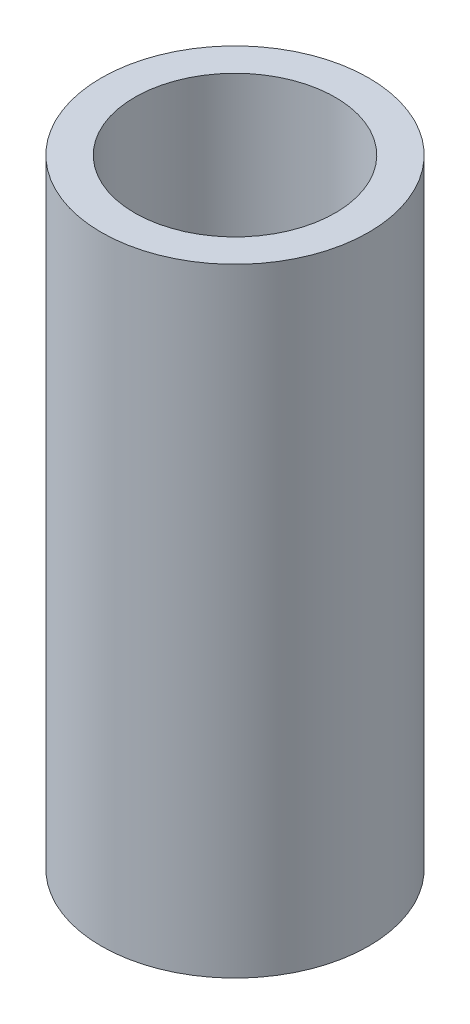
ISO-10303-21;
HEADER;
FILE_DESCRIPTION(('STEP AP214'),'2;1');
FILE_NAME('part.step','',(''),(''),'','','');
FILE_SCHEMA(('AUTOMOTIVE_DESIGN { 1 0 10303 214 1 1 1 1 }'));
ENDSEC;
DATA;
#1=APPLICATION_CONTEXT('core data for automotive mechanical design processes');
#2=APPLICATION_PROTOCOL_DEFINITION('international standard','automotive_design',2000,#1);
#3=PRODUCT_CONTEXT('',#1,'mechanical');
#4=PRODUCT('Part','Part','',(#3));
#5=PRODUCT_RELATED_PRODUCT_CATEGORY('part','',(#4));
#6=PRODUCT_DEFINITION_FORMATION('','',#4);
#7=PRODUCT_DEFINITION_CONTEXT('part definition',#1,'design');
#8=PRODUCT_DEFINITION('design','',#6,#7);
#9=PRODUCT_DEFINITION_SHAPE('','',#8);
#10=(LENGTH_UNIT() NAMED_UNIT(*) SI_UNIT(.MILLI.,.METRE.));
#11=(NAMED_UNIT(*) PLANE_ANGLE_UNIT() SI_UNIT($,.RADIAN.));
#12=(NAMED_UNIT(*) SI_UNIT($,.STERADIAN.) SOLID_ANGLE_UNIT());
#13=UNCERTAINTY_MEASURE_WITH_UNIT(LENGTH_MEASURE(1.E-05),#10,'distance_accuracy_value','');
#14=(GEOMETRIC_REPRESENTATION_CONTEXT(3) GLOBAL_UNCERTAINTY_ASSIGNED_CONTEXT((#13)) GLOBAL_UNIT_ASSIGNED_CONTEXT((#10,
#11,#12)) REPRESENTATION_CONTEXT('',''));
#15=CARTESIAN_POINT('',(0.,0.,0.));
#16=DIRECTION('',(0.,0.,1.));
#17=DIRECTION('',(1.,0.,0.));
#18=AXIS2_PLACEMENT_3D('',#15,#16,#17);
#19=CARTESIAN_POINT('',(0.,46.2111680227858,0.));
#20=DIRECTION('',(0.,-1.,0.));
#21=DIRECTION('',(0.,0.,-1.));
#22=AXIS2_PLACEMENT_3D('',#19,#20,#21);
#23=CYLINDRICAL_SURFACE('',#22,10.);
#24=CARTESIAN_POINT('',(0.,46.2111680227858,0.));
#25=DIRECTION('',(0.,1.,0.));
#26=DIRECTION('',(0.,0.,1.));
#27=AXIS2_PLACEMENT_3D('',#24,#25,#26);
#28=CIRCLE('',#27,10.);
#29=CARTESIAN_POINT('',(0.,46.2111680227858,10.));
#30=VERTEX_POINT('',#29);
#31=EDGE_CURVE('E10',#30,#30,#28,.T.);
#32=ORIENTED_EDGE('',*,*,#31,.F.);
#33=EDGE_LOOP('',(#32));
#34=FACE_BOUND('',#33,.T.);
#35=CARTESIAN_POINT('',(0.,0.,0.));
#36=DIRECTION('',(0.,1.,0.));
#37=DIRECTION('',(0.,0.,1.));
#38=AXIS2_PLACEMENT_3D('',#35,#36,#37);
#39=CIRCLE('',#38,10.);
#40=CARTESIAN_POINT('',(0.,0.,10.));
#41=VERTEX_POINT('',#40);
#42=EDGE_CURVE('E37',#41,#41,#39,.T.);
#43=ORIENTED_EDGE('',*,*,#42,.T.);
#44=EDGE_LOOP('',(#43));
#45=FACE_BOUND('',#44,.T.);
#46=ADVANCED_FACE('F40',(#34,#45),#23,.T.);
#47=CARTESIAN_POINT('',(0.,46.2111680227858,0.));
#48=DIRECTION('',(0.,1.,0.));
#49=DIRECTION('',(0.,0.,1.));
#50=AXIS2_PLACEMENT_3D('',#47,#48,#49);
#51=PLANE('',#50);
#52=CARTESIAN_POINT('',(0.,46.2111680227858,0.));
#53=DIRECTION('',(0.,1.,0.));
#54=DIRECTION('',(0.,0.,1.));
#55=AXIS2_PLACEMENT_3D('',#52,#53,#54);
#56=CIRCLE('',#55,7.4950039682485);
#57=CARTESIAN_POINT('',(0.,46.2111680227858,7.4950039682485));
#58=VERTEX_POINT('',#57);
#59=EDGE_CURVE('E50',#58,#58,#56,.T.);
#60=ORIENTED_EDGE('',*,*,#59,.F.);
#61=EDGE_LOOP('',(#60));
#62=FACE_BOUND('',#61,.T.);
#63=ORIENTED_EDGE('',*,*,#31,.T.);
#64=EDGE_LOOP('',(#63));
#65=FACE_BOUND('',#64,.T.);
#66=ADVANCED_FACE('F59',(#62,#65),#51,.T.);
#67=CARTESIAN_POINT('',(0.,0.,0.));
#68=DIRECTION('',(0.,1.,0.));
#69=DIRECTION('',(0.,0.,1.));
#70=AXIS2_PLACEMENT_3D('',#67,#68,#69);
#71=PLANE('',#70);
#72=CARTESIAN_POINT('',(0.,0.,0.));
#73=DIRECTION('',(0.,1.,0.));
#74=DIRECTION('',(0.,0.,1.));
#75=AXIS2_PLACEMENT_3D('',#72,#73,#74);
#76=CIRCLE('',#75,7.4950039682485);
#77=CARTESIAN_POINT('',(0.,0.,7.4950039682485));
#78=VERTEX_POINT('',#77);
#79=EDGE_CURVE('E47',#78,#78,#76,.T.);
#80=ORIENTED_EDGE('',*,*,#79,.T.);
#81=EDGE_LOOP('',(#80));
#82=FACE_BOUND('',#81,.T.);
#83=ORIENTED_EDGE('',*,*,#42,.F.);
#84=EDGE_LOOP('',(#83));
#85=FACE_BOUND('',#84,.T.);
#86=ADVANCED_FACE('F58',(#82,#85),#71,.F.);
#87=CARTESIAN_POINT('',(0.,46.2111680227858,0.));
#88=DIRECTION('',(0.,-1.,0.));
#89=DIRECTION('',(0.,0.,-1.));
#90=AXIS2_PLACEMENT_3D('',#87,#88,#89);
#91=CYLINDRICAL_SURFACE('',#90,7.4950039682485);
#92=ORIENTED_EDGE('',*,*,#59,.T.);
#93=EDGE_LOOP('',(#92));
#94=FACE_BOUND('',#93,.T.);
#95=ORIENTED_EDGE('',*,*,#79,.F.);
#96=EDGE_LOOP('',(#95));
#97=FACE_BOUND('',#96,.T.);
#98=ADVANCED_FACE('F54',(#94,#97),#91,.F.);
#99=CLOSED_SHELL('',(#46,#66,#86,#98));
#100=MANIFOLD_SOLID_BREP('B2',#99);
#101=ADVANCED_BREP_SHAPE_REPRESENTATION('',(#18,#100),#14);
#102=SHAPE_DEFINITION_REPRESENTATION(#9,#101);
ENDSEC;
END-ISO-10303-21;
